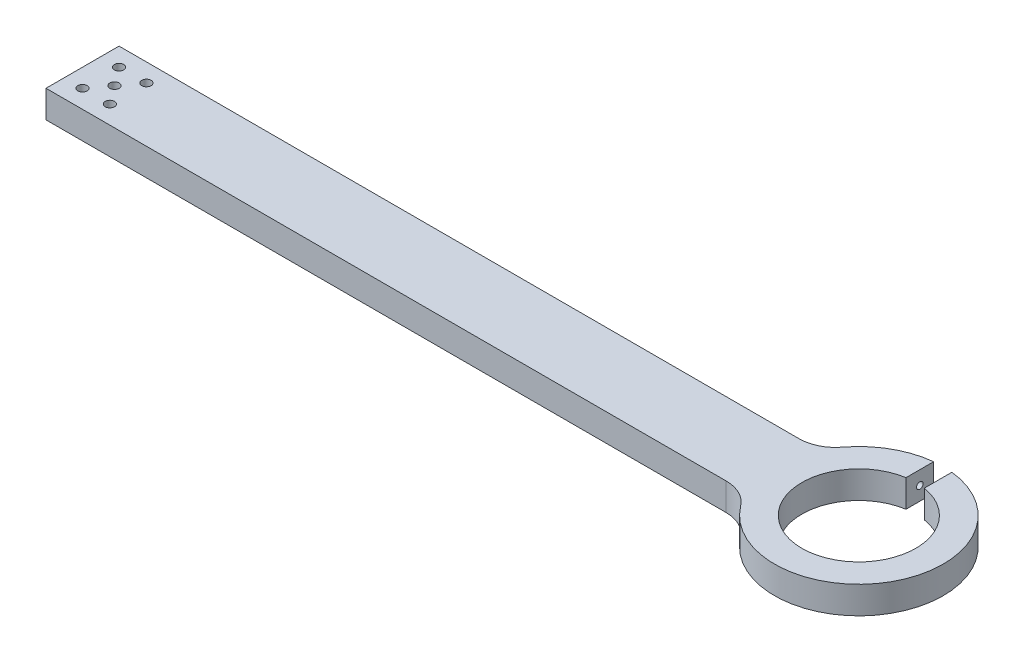
ISO-10303-21;
HEADER;
FILE_DESCRIPTION(('STEP AP214'),'2;1');
FILE_NAME('part.step','',(''),(''),'','','');
FILE_SCHEMA(('AUTOMOTIVE_DESIGN { 1 0 10303 214 1 1 1 1 }'));
ENDSEC;
DATA;
#1=APPLICATION_CONTEXT('core data for automotive mechanical design processes');
#2=APPLICATION_PROTOCOL_DEFINITION('international standard','automotive_design',2000,#1);
#3=PRODUCT_CONTEXT('',#1,'mechanical');
#4=PRODUCT('Part','Part','',(#3));
#5=PRODUCT_RELATED_PRODUCT_CATEGORY('part','',(#4));
#6=PRODUCT_DEFINITION_FORMATION('','',#4);
#7=PRODUCT_DEFINITION_CONTEXT('part definition',#1,'design');
#8=PRODUCT_DEFINITION('design','',#6,#7);
#9=PRODUCT_DEFINITION_SHAPE('','',#8);
#10=(LENGTH_UNIT() NAMED_UNIT(*) SI_UNIT(.MILLI.,.METRE.));
#11=(NAMED_UNIT(*) PLANE_ANGLE_UNIT() SI_UNIT($,.RADIAN.));
#12=(NAMED_UNIT(*) SI_UNIT($,.STERADIAN.) SOLID_ANGLE_UNIT());
#13=UNCERTAINTY_MEASURE_WITH_UNIT(LENGTH_MEASURE(1.E-05),#10,'distance_accuracy_value','');
#14=(GEOMETRIC_REPRESENTATION_CONTEXT(3) GLOBAL_UNCERTAINTY_ASSIGNED_CONTEXT((#13)) GLOBAL_UNIT_ASSIGNED_CONTEXT((#10,
#11,#12)) REPRESENTATION_CONTEXT('',''));
#15=CARTESIAN_POINT('',(0.,0.,0.));
#16=DIRECTION('',(0.,0.,1.));
#17=DIRECTION('',(1.,0.,0.));
#18=AXIS2_PLACEMENT_3D('',#15,#16,#17);
#19=CARTESIAN_POINT('',(0.,4.7625,-12.7));
#20=DIRECTION('',(1.,0.,0.));
#21=DIRECTION('',(0.,0.,-1.));
#22=AXIS2_PLACEMENT_3D('',#19,#20,#21);
#23=PLANE('',#22);
#24=DIRECTION('',(0.,0.,1.));
#25=VECTOR('',#24,1.);
#26=CARTESIAN_POINT('',(0.,-4.7625,-12.7));
#27=LINE('',#26,#25);
#28=CARTESIAN_POINT('',(0.,-4.7625,-12.7));
#29=VERTEX_POINT('',#28);
#30=CARTESIAN_POINT('',(0.,-4.7625,12.7));
#31=VERTEX_POINT('',#30);
#32=EDGE_CURVE('E228',#29,#31,#27,.T.);
#33=ORIENTED_EDGE('',*,*,#32,.T.);
#34=DIRECTION('',(0.,-1.,0.));
#35=VECTOR('',#34,1.);
#36=CARTESIAN_POINT('',(0.,4.7625,12.7));
#37=LINE('',#36,#35);
#38=CARTESIAN_POINT('',(0.,4.7625,12.7));
#39=VERTEX_POINT('',#38);
#40=EDGE_CURVE('E256',#39,#31,#37,.T.);
#41=ORIENTED_EDGE('',*,*,#40,.F.);
#42=DIRECTION('',(0.,0.,1.));
#43=VECTOR('',#42,1.);
#44=CARTESIAN_POINT('',(0.,4.7625,-12.7));
#45=LINE('',#44,#43);
#46=CARTESIAN_POINT('',(0.,4.7625,-12.7));
#47=VERTEX_POINT('',#46);
#48=EDGE_CURVE('E245',#47,#39,#45,.T.);
#49=ORIENTED_EDGE('',*,*,#48,.F.);
#50=DIRECTION('',(0.,-1.,0.));
#51=VECTOR('',#50,1.);
#52=CARTESIAN_POINT('',(0.,4.7625,-12.7));
#53=LINE('',#52,#51);
#54=EDGE_CURVE('E219',#47,#29,#53,.T.);
#55=ORIENTED_EDGE('',*,*,#54,.T.);
#56=EDGE_LOOP('',(#33,#41,#49,#55));
#57=FACE_BOUND('',#56,.T.);
#58=ADVANCED_FACE('F38',(#57),#23,.F.);
#59=CARTESIAN_POINT('',(0.,4.7625,12.7));
#60=DIRECTION('',(0.,0.,-1.));
#61=DIRECTION('',(-1.,0.,0.));
#62=AXIS2_PLACEMENT_3D('',#59,#60,#61);
#63=PLANE('',#62);
#64=DIRECTION('',(1.,0.,0.));
#65=VECTOR('',#64,1.);
#66=CARTESIAN_POINT('',(0.,-4.7625,12.7));
#67=LINE('',#66,#65);
#68=CARTESIAN_POINT('',(236.48855016431,-4.7625,12.7));
#69=VERTEX_POINT('',#68);
#70=EDGE_CURVE('E230',#31,#69,#67,.T.);
#71=ORIENTED_EDGE('',*,*,#70,.T.);
#72=DIRECTION('',(0.,1.,0.));
#73=VECTOR('',#72,1.);
#74=CARTESIAN_POINT('',(236.48855016431,4.7625,12.7));
#75=LINE('',#74,#73);
#76=CARTESIAN_POINT('',(236.48855016431,4.7625,12.7));
#77=VERTEX_POINT('',#76);
#78=EDGE_CURVE('E66',#69,#77,#75,.T.);
#79=ORIENTED_EDGE('',*,*,#78,.T.);
#80=DIRECTION('',(1.,0.,0.));
#81=VECTOR('',#80,1.);
#82=CARTESIAN_POINT('',(0.,4.7625,12.7));
#83=LINE('',#82,#81);
#84=EDGE_CURVE('E153',#39,#77,#83,.T.);
#85=ORIENTED_EDGE('',*,*,#84,.F.);
#86=ORIENTED_EDGE('',*,*,#40,.T.);
#87=EDGE_LOOP('',(#71,#79,#85,#86));
#88=FACE_BOUND('',#87,.T.);
#89=ADVANCED_FACE('F140',(#88),#63,.F.);
#90=CARTESIAN_POINT('',(270.,4.7625,0.));
#91=DIRECTION('',(0.,-1.,0.));
#92=DIRECTION('',(0.,0.,-1.));
#93=AXIS2_PLACEMENT_3D('',#90,#91,#92);
#94=CYLINDRICAL_SURFACE('',#93,29.3497);
#95=DIRECTION('',(0.,-1.,0.));
#96=VECTOR('',#95,1.);
#97=CARTESIAN_POINT('',(282.7,4.7625,-26.4596842401794));
#98=LINE('',#97,#96);
#99=CARTESIAN_POINT('',(282.7,1.21197066000445,-26.4596842401794));
#100=VERTEX_POINT('',#99);
#101=CARTESIAN_POINT('',(282.7,-1.21197066000445,-26.4596842401794));
#102=VERTEX_POINT('',#101);
#103=EDGE_CURVE('E126',#100,#102,#98,.T.);
#104=ORIENTED_EDGE('',*,*,#103,.T.);
#105=CARTESIAN_POINT('',(282.7,-1.21197066000444,-26.4596842401794));
#106=CARTESIAN_POINT('',(282.750051124197,-1.25329873764153,-26.4356625780796));
#107=CARTESIAN_POINT('',(282.801101674612,-1.29298690635019,-26.410983284436));
#108=CARTESIAN_POINT('',(282.904794393227,-1.36936711915129,-26.3604717622231));
#109=CARTESIAN_POINT('',(282.957435520752,-1.40606106651418,-26.3346402824479));
#110=CARTESIAN_POINT('',(283.063833295128,-1.47669976053063,-26.2820218081668));
#111=CARTESIAN_POINT('',(283.117586803677,-1.51065118896463,-26.2552373800173));
#112=CARTESIAN_POINT('',(283.226095306812,-1.57614137180364,-26.2007439111944));
#113=CARTESIAN_POINT('',(283.280850488706,-1.60767966913271,-26.1730346967758));
#114=CARTESIAN_POINT('',(283.446043511303,-1.69882315409589,-26.0887723031969));
#115=CARTESIAN_POINT('',(283.557670149274,-1.75512699525818,-26.0309553772976));
#116=CARTESIAN_POINT('',(283.783039062422,-1.86002520705119,-25.9123327380884));
#117=CARTESIAN_POINT('',(283.896783245729,-1.90861220690676,-25.8515242390968));
#118=CARTESIAN_POINT('',(284.200626335862,-2.0282936869004,-25.6864458794719));
#119=CARTESIAN_POINT('',(284.391885634554,-2.09325560647805,-25.5798235297073));
#120=CARTESIAN_POINT('',(284.775808655515,-2.20541868807797,-25.3599955728221));
#121=CARTESIAN_POINT('',(284.968472715948,-2.25261541930172,-25.2467883314875));
#122=CARTESIAN_POINT('',(285.354372896863,-2.32958557802799,-25.0139776286063));
#123=CARTESIAN_POINT('',(285.547608656684,-2.35929738328666,-24.894353147345));
#124=CARTESIAN_POINT('',(285.932571574913,-2.40029686390625,-24.649746531512));
#125=CARTESIAN_POINT('',(286.124299409049,-2.41159332209235,-24.5247669801382));
#126=CARTESIAN_POINT('',(286.442962432453,-2.41374256663724,-24.3116796786579));
#127=CARTESIAN_POINT('',(286.570694218422,-2.41004849374634,-24.2247967952362));
#128=CARTESIAN_POINT('',(286.824310246248,-2.39280267618088,-24.0493498794949));
#129=CARTESIAN_POINT('',(286.950194931957,-2.37925334062029,-23.9607862631815));
#130=CARTESIAN_POINT('',(287.199128997994,-2.34142105749057,-23.7827288540588));
#131=CARTESIAN_POINT('',(287.322185748331,-2.31717041739526,-23.6932386467833));
#132=CARTESIAN_POINT('',(287.5649649807,-2.25678991766118,-23.5138188167865));
#133=CARTESIAN_POINT('',(287.684688896582,-2.2206652548867,-23.4238894032237));
#134=CARTESIAN_POINT('',(287.953273879696,-2.12292745017628,-23.2189761435059));
#135=CARTESIAN_POINT('',(288.100727584217,-2.05698596681019,-23.1041475069809));
#136=CARTESIAN_POINT('',(288.384957972101,-1.89944125062337,-22.8786135039784));
#137=CARTESIAN_POINT('',(288.521743972152,-1.80786073806069,-22.7679045847363));
#138=CARTESIAN_POINT('',(288.742343697789,-1.62527955835916,-22.5863619431623));
#139=CARTESIAN_POINT('',(288.83015598297,-1.54152763434976,-22.513145055175));
#140=CARTESIAN_POINT('',(288.994222049655,-1.35749904563977,-22.3748932961783));
#141=CARTESIAN_POINT('',(289.070495217096,-1.25725070050145,-22.3098447341988));
#142=CARTESIAN_POINT('',(289.191004583641,-1.06574490090438,-22.2061930709192));
#143=CARTESIAN_POINT('',(289.238547796922,-0.978001965855499,-22.1649777682916));
#144=CARTESIAN_POINT('',(289.322131183464,-0.793420723564877,-22.0921526960081));
#145=CARTESIAN_POINT('',(289.358177547699,-0.696587347950246,-22.0605377570628));
#146=CARTESIAN_POINT('',(289.416649598477,-0.494780799216568,-22.0090928381109));
#147=CARTESIAN_POINT('',(289.438947211099,-0.389741063856326,-21.9893737068967));
#148=CARTESIAN_POINT('',(289.467445805109,-0.175843841064166,-21.9641488228857));
#149=CARTESIAN_POINT('',(289.473661963957,-0.0669900517226581,-21.9586296683691));
#150=CARTESIAN_POINT('',(289.469763100197,0.134552784015755,-21.9620854116629));
#151=CARTESIAN_POINT('',(289.461852783386,0.227331070312829,-21.9691036618426));
#152=CARTESIAN_POINT('',(289.434394909052,0.409745551033289,-21.9933971298041));
#153=CARTESIAN_POINT('',(289.414846467199,0.499381506136451,-22.0106731270273));
#154=CARTESIAN_POINT('',(289.365390772965,0.673140054368543,-22.0541967814052));
#155=CARTESIAN_POINT('',(289.335509145763,0.757275679669371,-22.0804222427621));
#156=CARTESIAN_POINT('',(289.266902238231,0.91898340384426,-22.1403126641297));
#157=CARTESIAN_POINT('',(289.228173446809,0.996552880075071,-22.1739805775862));
#158=CARTESIAN_POINT('',(289.121300375129,1.18302893266705,-22.2662965093944));
#159=CARTESIAN_POINT('',(289.048333243675,1.28725175616303,-22.3288295121896));
#160=CARTESIAN_POINT('',(288.889917874362,1.47911189090206,-22.4630074963159));
#161=CARTESIAN_POINT('',(288.804437732063,1.5667054505264,-22.5346757074559));
#162=CARTESIAN_POINT('',(288.647437639819,1.70593046267336,-22.664632431965));
#163=CARTESIAN_POINT('',(288.577907737849,1.7610389597119,-22.7216791488172));
#164=CARTESIAN_POINT('',(288.434833802162,1.86323917502304,-22.8379139581896));
#165=CARTESIAN_POINT('',(288.361287821249,1.91032695805076,-22.8971030846828));
#166=CARTESIAN_POINT('',(288.135784709005,2.04053964340112,-23.0767188299202));
#167=CARTESIAN_POINT('',(287.978985561554,2.11259428432524,-23.1991745515965));
#168=CARTESIAN_POINT('',(287.690821331106,2.21912366037501,-23.4193423265481));
#169=CARTESIAN_POINT('',(287.560966164589,2.25830076911906,-23.5168923099072));
#170=CARTESIAN_POINT('',(287.297352222307,2.3227702938882,-23.7114593398893));
#171=CARTESIAN_POINT('',(287.163591282834,2.34805485396269,-23.8084760543277));
#172=CARTESIAN_POINT('',(286.892829764393,2.38622036566326,-24.0013529175634));
#173=CARTESIAN_POINT('',(286.755819475929,2.39905754395495,-24.0972078224877));
#174=CARTESIAN_POINT('',(286.479810204677,2.41332721083388,-24.2868027604675));
#175=CARTESIAN_POINT('',(286.340811399758,2.41476071314656,-24.3805429807684));
#176=CARTESIAN_POINT('',(286.008756518469,2.40565909524498,-24.6003612318301));
#177=CARTESIAN_POINT('',(285.815072607554,2.39040909199523,-24.7253104389047));
#178=CARTESIAN_POINT('',(285.426457631297,2.34143063682995,-24.9696223888027));
#179=CARTESIAN_POINT('',(285.231526011326,2.30769330800274,-25.0889824180064));
#180=CARTESIAN_POINT('',(284.842686875056,2.22248222059297,-25.3209499477443));
#181=CARTESIAN_POINT('',(284.64877867064,2.17108828508829,-25.4335852052758));
#182=CARTESIAN_POINT('',(284.359382433434,2.08031118283989,-25.5973698517258));
#183=CARTESIAN_POINT('',(284.263165111932,2.04777266054992,-25.6511013539634));
#184=CARTESIAN_POINT('',(284.07147800756,1.97792227129344,-25.7567536844921));
#185=CARTESIAN_POINT('',(283.976008117014,1.94061110582742,-25.8086747774594));
#186=CARTESIAN_POINT('',(283.778048095649,1.85750937440061,-25.9149369382837));
#187=CARTESIAN_POINT('',(283.675654703319,1.81126678624605,-25.9691060102252));
#188=CARTESIAN_POINT('',(283.472828019839,1.71224433666097,-26.0749084988788));
#189=CARTESIAN_POINT('',(283.372393135544,1.65947006916782,-26.1265440331807));
#190=CARTESIAN_POINT('',(283.223723310413,1.57464347819945,-26.2019300483732));
#191=CARTESIAN_POINT('',(283.174429879561,1.54537904145109,-26.2267472762266));
#192=CARTESIAN_POINT('',(283.076718552324,1.48482030201255,-26.2756028270637));
#193=CARTESIAN_POINT('',(283.028300523769,1.45352630907711,-26.2996412680715));
#194=CARTESIAN_POINT('',(282.932427608899,1.38865451153463,-26.3469175479996));
#195=CARTESIAN_POINT('',(282.884975077183,1.35507183155355,-26.3701535082139));
#196=CARTESIAN_POINT('',(282.791406315453,1.28543258281486,-26.4156684420658));
#197=CARTESIAN_POINT('',(282.74529078773,1.24937474625063,-26.4379469156224));
#198=CARTESIAN_POINT('',(282.699999999999,1.21197066000634,-26.4596842401798));
#199=B_SPLINE_CURVE_WITH_KNOTS('',3,(#105,#106,#107,#108,#109,#110,#111,#112,#113,#114,#115,
#116,#117,#118,#119,#120,#121,#122,#123,#124,#125,#126,#127,#128,#129,#130,#131,#132,#133,#134,
#135,#136,#137,#138,#139,#140,#141,#142,#143,#144,#145,#146,#147,#148,#149,#150,#151,#152,#153,
#154,#155,#156,#157,#158,#159,#160,#161,#162,#163,#164,#165,#166,#167,#168,#169,#170,#171,#172,
#173,#174,#175,#176,#177,#178,#179,#180,#181,#182,#183,#184,#185,#186,#187,#188,#189,#190,#191,
#192,#193,#194,#195,#196,#197,#198),.UNSPECIFIED.,.F.,.F.,(4,2,2,2,2,2,2,2,2,2,2,2,2,2,2,2,2,2,
2,2,2,2,2,2,2,2,2,2,2,2,2,2,2,2,2,2,2,2,2,2,2,2,2,2,2,2,4),(0.,0.207562156677144,
0.414991332138695,0.621898852492137,0.828845467086886,1.24172900993071,1.65500457894354,
2.33927596653268,3.0237179046852,3.71055779991054,4.39707002488198,4.86035384150416,
5.32352444667576,5.78530619555345,6.24688610645155,6.83986122126179,7.43231252007061,
7.85619809293541,8.27936342698228,8.60207934672442,8.92462119159159,9.25012393414576,
9.57531935933573,9.85409090780531,10.1328836416188,10.4109898998814,10.6892067199591,
11.1121202986101,11.536131594201,11.852141000048,12.1683050074194,12.8007395675926,
13.3013668329185,13.802276902076,14.3049421858432,14.8075627848725,15.4996316809521,
16.1920331737853,16.8813447321341,17.2259734717627,17.5705516146831,17.9445563533469,
18.318242970632,18.5056087181306,18.6929459365014,18.8806955107322,19.0685419808),.UNSPECIFIED.);
#200=EDGE_CURVE('E11',#102,#100,#199,.T.);
#201=ORIENTED_EDGE('',*,*,#200,.T.);
#202=EDGE_LOOP('',(#104,#201));
#203=FACE_BOUND('',#202,.T.);
#204=CARTESIAN_POINT('',(270.,4.7625,0.));
#205=DIRECTION('',(0.,1.,0.));
#206=DIRECTION('',(0.,0.,-1.));
#207=AXIS2_PLACEMENT_3D('',#204,#205,#206);
#208=CIRCLE('',#207,29.3497);
#209=CARTESIAN_POINT('',(246.609797471978,4.7625,17.7286016309272));
#210=VERTEX_POINT('',#209);
#211=CARTESIAN_POINT('',(273.175,4.7625,-29.177461594354));
#212=VERTEX_POINT('',#211);
#213=EDGE_CURVE('E144',#210,#212,#208,.T.);
#214=ORIENTED_EDGE('',*,*,#213,.F.);
#215=DIRECTION('',(0.,-1.,0.));
#216=VECTOR('',#215,1.);
#217=CARTESIAN_POINT('',(246.609797471978,4.7625,17.7286016309272));
#218=LINE('',#217,#216);
#219=CARTESIAN_POINT('',(246.609797471978,-4.7625,17.7286016309272));
#220=VERTEX_POINT('',#219);
#221=EDGE_CURVE('E146',#210,#220,#218,.T.);
#222=ORIENTED_EDGE('',*,*,#221,.T.);
#223=CARTESIAN_POINT('',(270.,-4.7625,0.));
#224=DIRECTION('',(0.,1.,0.));
#225=DIRECTION('',(0.,0.,-1.));
#226=AXIS2_PLACEMENT_3D('',#223,#224,#225);
#227=CIRCLE('',#226,29.3497);
#228=CARTESIAN_POINT('',(273.175,-4.7625,-29.177461594354));
#229=VERTEX_POINT('',#228);
#230=EDGE_CURVE('E233',#220,#229,#227,.T.);
#231=ORIENTED_EDGE('',*,*,#230,.T.);
#232=DIRECTION('',(0.,-1.,0.));
#233=VECTOR('',#232,1.);
#234=CARTESIAN_POINT('',(273.175,4.7625,-29.177461594354));
#235=LINE('',#234,#233);
#236=EDGE_CURVE('E149',#212,#229,#235,.T.);
#237=ORIENTED_EDGE('',*,*,#236,.F.);
#238=EDGE_LOOP('',(#214,#222,#231,#237));
#239=FACE_BOUND('',#238,.T.);
#240=ADVANCED_FACE('F136',(#203,#239),#94,.T.);
#241=CARTESIAN_POINT('',(273.175,4.7625,-29.177461594354));
#242=DIRECTION('',(1.,0.,0.));
#243=DIRECTION('',(0.,0.,-1.));
#244=AXIS2_PLACEMENT_3D('',#241,#242,#243);
#245=PLANE('',#244);
#246=CARTESIAN_POINT('',(273.175,0.,-24.3731329900808));
#247=DIRECTION('',(-1.,0.,0.));
#248=DIRECTION('',(0.,0.,1.));
#249=AXIS2_PLACEMENT_3D('',#246,#247,#248);
#250=CIRCLE('',#249,1.1303);
#251=CARTESIAN_POINT('',(273.175,0.,-23.2428329900808));
#252=VERTEX_POINT('',#251);
#253=EDGE_CURVE('E129',#252,#252,#250,.T.);
#254=ORIENTED_EDGE('',*,*,#253,.F.);
#255=EDGE_LOOP('',(#254));
#256=FACE_BOUND('',#255,.T.);
#257=DIRECTION('',(0.,0.,1.));
#258=VECTOR('',#257,1.);
#259=CARTESIAN_POINT('',(273.175,-4.7625,-29.177461594354));
#260=LINE('',#259,#258);
#261=CARTESIAN_POINT('',(273.175,-4.7625,-19.5688043858076));
#262=VERTEX_POINT('',#261);
#263=EDGE_CURVE('E235',#229,#262,#260,.T.);
#264=ORIENTED_EDGE('',*,*,#263,.T.);
#265=DIRECTION('',(0.,-1.,0.));
#266=VECTOR('',#265,1.);
#267=CARTESIAN_POINT('',(273.175,4.7625,-19.5688043858076));
#268=LINE('',#267,#266);
#269=CARTESIAN_POINT('',(273.175,4.7625,-19.5688043858076));
#270=VERTEX_POINT('',#269);
#271=EDGE_CURVE('E252',#270,#262,#268,.T.);
#272=ORIENTED_EDGE('',*,*,#271,.F.);
#273=DIRECTION('',(0.,0.,1.));
#274=VECTOR('',#273,1.);
#275=CARTESIAN_POINT('',(273.175,4.7625,-29.177461594354));
#276=LINE('',#275,#274);
#277=EDGE_CURVE('E152',#212,#270,#276,.T.);
#278=ORIENTED_EDGE('',*,*,#277,.F.);
#279=ORIENTED_EDGE('',*,*,#236,.T.);
#280=EDGE_LOOP('',(#264,#272,#278,#279));
#281=FACE_BOUND('',#280,.T.);
#282=ADVANCED_FACE('F139',(#256,#281),#245,.F.);
#283=CARTESIAN_POINT('',(270.,4.7625,0.));
#284=DIRECTION('',(0.,-1.,0.));
#285=DIRECTION('',(0.,0.,-1.));
#286=AXIS2_PLACEMENT_3D('',#283,#284,#285);
#287=CYLINDRICAL_SURFACE('',#286,19.8247);
#288=CARTESIAN_POINT('',(270.,-4.7625,0.));
#289=DIRECTION('',(0.,-1.,0.));
#290=DIRECTION('',(0.,0.,1.));
#291=AXIS2_PLACEMENT_3D('',#288,#289,#290);
#292=CIRCLE('',#291,19.8247);
#293=CARTESIAN_POINT('',(266.825,-4.7625,-19.5688043858076));
#294=VERTEX_POINT('',#293);
#295=EDGE_CURVE('E237',#262,#294,#292,.T.);
#296=ORIENTED_EDGE('',*,*,#295,.T.);
#297=DIRECTION('',(0.,-1.,0.));
#298=VECTOR('',#297,1.);
#299=CARTESIAN_POINT('',(266.825,4.7625,-19.5688043858076));
#300=LINE('',#299,#298);
#301=CARTESIAN_POINT('',(266.825,4.7625,-19.5688043858076));
#302=VERTEX_POINT('',#301);
#303=EDGE_CURVE('E249',#302,#294,#300,.T.);
#304=ORIENTED_EDGE('',*,*,#303,.F.);
#305=CARTESIAN_POINT('',(270.,4.7625,0.));
#306=DIRECTION('',(0.,-1.,0.));
#307=DIRECTION('',(0.,0.,1.));
#308=AXIS2_PLACEMENT_3D('',#305,#306,#307);
#309=CIRCLE('',#308,19.8247);
#310=EDGE_CURVE('E306',#270,#302,#309,.T.);
#311=ORIENTED_EDGE('',*,*,#310,.F.);
#312=ORIENTED_EDGE('',*,*,#271,.T.);
#313=EDGE_LOOP('',(#296,#304,#311,#312));
#314=FACE_BOUND('',#313,.T.);
#315=ADVANCED_FACE('F289',(#314),#287,.F.);
#316=CARTESIAN_POINT('',(266.825,4.7625,-19.5688043858076));
#317=DIRECTION('',(-1.,0.,0.));
#318=DIRECTION('',(0.,0.,1.));
#319=AXIS2_PLACEMENT_3D('',#316,#317,#318);
#320=PLANE('',#319);
#321=CARTESIAN_POINT('',(266.825,0.,-24.3731329900808));
#322=DIRECTION('',(1.,0.,0.));
#323=DIRECTION('',(0.,0.,-1.));
#324=AXIS2_PLACEMENT_3D('',#321,#322,#323);
#325=CIRCLE('',#324,1.13029999999997);
#326=CARTESIAN_POINT('',(266.825,0.,-25.5034329900807));
#327=VERTEX_POINT('',#326);
#328=EDGE_CURVE('E265',#327,#327,#325,.T.);
#329=ORIENTED_EDGE('',*,*,#328,.F.);
#330=EDGE_LOOP('',(#329));
#331=FACE_BOUND('',#330,.T.);
#332=DIRECTION('',(0.,0.,-1.));
#333=VECTOR('',#332,1.);
#334=CARTESIAN_POINT('',(266.825,-4.7625,-19.5688043858076));
#335=LINE('',#334,#333);
#336=CARTESIAN_POINT('',(266.825,-4.7625,-29.177461594354));
#337=VERTEX_POINT('',#336);
#338=EDGE_CURVE('E239',#294,#337,#335,.T.);
#339=ORIENTED_EDGE('',*,*,#338,.T.);
#340=DIRECTION('',(0.,-1.,0.));
#341=VECTOR('',#340,1.);
#342=CARTESIAN_POINT('',(266.825,4.7625,-29.177461594354));
#343=LINE('',#342,#341);
#344=CARTESIAN_POINT('',(266.825,4.7625,-29.177461594354));
#345=VERTEX_POINT('',#344);
#346=EDGE_CURVE('E222',#345,#337,#343,.T.);
#347=ORIENTED_EDGE('',*,*,#346,.F.);
#348=DIRECTION('',(0.,0.,-1.));
#349=VECTOR('',#348,1.);
#350=CARTESIAN_POINT('',(266.825,4.7625,-19.5688043858076));
#351=LINE('',#350,#349);
#352=EDGE_CURVE('E224',#302,#345,#351,.T.);
#353=ORIENTED_EDGE('',*,*,#352,.F.);
#354=ORIENTED_EDGE('',*,*,#303,.T.);
#355=EDGE_LOOP('',(#339,#347,#353,#354));
#356=FACE_BOUND('',#355,.T.);
#357=ADVANCED_FACE('F284',(#331,#356),#320,.F.);
#358=CARTESIAN_POINT('',(270.,4.7625,0.));
#359=DIRECTION('',(0.,-1.,0.));
#360=DIRECTION('',(0.,0.,-1.));
#361=AXIS2_PLACEMENT_3D('',#358,#359,#360);
#362=CYLINDRICAL_SURFACE('',#361,29.3497);
#363=CARTESIAN_POINT('',(255.4748564272,0.,-25.5034329900807));
#364=CARTESIAN_POINT('',(255.474852557362,0.0338034003049227,-25.5034308534571));
#365=CARTESIAN_POINT('',(255.472162361053,0.0676516263213047,-25.5018991960165));
#366=CARTESIAN_POINT('',(255.461684603031,0.134307770758166,-25.4959273082542));
#367=CARTESIAN_POINT('',(255.453885688913,0.167113201283325,-25.4914806001978));
#368=CARTESIAN_POINT('',(255.43155720458,0.238412527803232,-25.4787276697649));
#369=CARTESIAN_POINT('',(255.415873770397,0.276422420750014,-25.4697583828014));
#370=CARTESIAN_POINT('',(255.379444398984,0.349020973931966,-25.4488641391816));
#371=CARTESIAN_POINT('',(255.358689691611,0.383603559847489,-25.4369340616341));
#372=CARTESIAN_POINT('',(255.300629302506,0.468107592844855,-25.4034456189282));
#373=CARTESIAN_POINT('',(255.260637177381,0.515521390312054,-25.3802776746506));
#374=CARTESIAN_POINT('',(255.175210371615,0.603006165636676,-25.3304751329926));
#375=CARTESIAN_POINT('',(255.129761923829,0.643057895649436,-25.3038317512596));
#376=CARTESIAN_POINT('',(255.039329517761,0.713912439508471,-25.2504605903019));
#377=CARTESIAN_POINT('',(254.994612748178,0.745204234368355,-25.2239186787796));
#378=CARTESIAN_POINT('',(254.903197701184,0.803284748708342,-25.1693124602008));
#379=CARTESIAN_POINT('',(254.856497847442,0.830069798619954,-25.1412469369154));
#380=CARTESIAN_POINT('',(254.761658152014,0.879693429727285,-25.0838774083796));
#381=CARTESIAN_POINT('',(254.713515828855,0.902524690612718,-25.0545712282887));
#382=CARTESIAN_POINT('',(254.616263692293,0.944573420449099,-24.994975584261));
#383=CARTESIAN_POINT('',(254.567153581154,0.963789757486269,-24.9646858158103));
#384=CARTESIAN_POINT('',(254.437194469858,1.00991322524006,-24.8839896614668));
#385=CARTESIAN_POINT('',(254.355786053725,1.03406916183391,-24.8328984527931));
#386=CARTESIAN_POINT('',(254.192038842279,1.07426698700852,-24.7289844977882));
#387=CARTESIAN_POINT('',(254.109699479066,1.09030361548036,-24.676160652497));
#388=CARTESIAN_POINT('',(253.94471353686,1.11452809556647,-24.5691338699686));
#389=CARTESIAN_POINT('',(253.862066839139,1.12271250756832,-24.5149303390313));
#390=CARTESIAN_POINT('',(253.697075787409,1.13116695368705,-24.4055186903934));
#391=CARTESIAN_POINT('',(253.614731311857,1.13144062506775,-24.3503110460563));
#392=CARTESIAN_POINT('',(253.470026259145,1.12462353528824,-24.2522290904614));
#393=CARTESIAN_POINT('',(253.407492429994,1.11923877194925,-24.209487453323));
#394=CARTESIAN_POINT('',(253.283206222322,1.10332495742019,-24.1238344280743));
#395=CARTESIAN_POINT('',(253.221453676361,1.09279702833389,-24.0809230790152));
#396=CARTESIAN_POINT('',(253.099221889358,1.06621827703574,-23.995294181338));
#397=CARTESIAN_POINT('',(253.038739957766,1.05018071518669,-23.9525764146519));
#398=CARTESIAN_POINT('',(252.919406017676,1.01203124480706,-23.8676257486051));
#399=CARTESIAN_POINT('',(252.860553053678,0.989922983995817,-23.825392573892));
#400=CARTESIAN_POINT('',(252.7378724992,0.935707031751531,-23.7366859489075));
#401=CARTESIAN_POINT('',(252.674342815225,0.902694780861699,-23.6903424595669));
#402=CARTESIAN_POINT('',(252.55157669975,0.826697020995685,-23.6000676341119));
#403=CARTESIAN_POINT('',(252.492337204488,0.783718723122521,-23.5561345821721));
#404=CARTESIAN_POINT('',(252.39441387659,0.698255498147121,-23.482993792439));
#405=CARTESIAN_POINT('',(252.354270904529,0.658280197541106,-23.4528323912634));
#406=CARTESIAN_POINT('',(252.27945176961,0.57110591240461,-23.3963510436987));
#407=CARTESIAN_POINT('',(252.244765469857,0.523920651319826,-23.3700239811524));
#408=CARTESIAN_POINT('',(252.191764151751,0.436289946922703,-23.3296467179237));
#409=CARTESIAN_POINT('',(252.171579152833,0.39762110381402,-23.3142186474939));
#410=CARTESIAN_POINT('',(252.136393936499,0.316692550164793,-23.2872703348297));
#411=CARTESIAN_POINT('',(252.121389936447,0.274435487579481,-23.2757472416946));
#412=CARTESIAN_POINT('',(252.097598463644,0.186709425486988,-23.2574534797052));
#413=CARTESIAN_POINT('',(252.088873072482,0.141213110469652,-23.2507302761451));
#414=CARTESIAN_POINT('',(252.078774435959,0.048941748411544,-23.2429475252839));
#415=CARTESIAN_POINT('',(252.07739436039,0.00216792998977353,-23.2418827163965));
#416=CARTESIAN_POINT('',(252.081774572962,-0.0841073691995423,-23.2452594924735));
#417=CARTESIAN_POINT('',(252.086545356926,-0.123695333428976,-23.2489380181471));
#418=CARTESIAN_POINT('',(252.101191593832,-0.201329126621615,-23.2602156578162));
#419=CARTESIAN_POINT('',(252.111069079333,-0.239374335033116,-23.2678163328952));
#420=CARTESIAN_POINT('',(252.138379289774,-0.322586204930334,-23.2887904164847));
#421=CARTESIAN_POINT('',(252.157099339349,-0.367080079999,-23.3031439141634));
#422=CARTESIAN_POINT('',(252.200074027832,-0.451633169267857,-23.3359863306524));
#423=CARTESIAN_POINT('',(252.224338122699,-0.491684631058186,-23.3544823138338));
#424=CARTESIAN_POINT('',(252.28866058965,-0.583814075319829,-23.4033245222533));
#425=CARTESIAN_POINT('',(252.330972528099,-0.633436507935609,-23.4353053163617));
#426=CARTESIAN_POINT('',(252.421393067201,-0.723889870077616,-23.5032058372586));
#427=CARTESIAN_POINT('',(252.46951394768,-0.764701648302725,-23.5391338934439));
#428=CARTESIAN_POINT('',(252.559914706211,-0.831327800552842,-23.6061611353018));
#429=CARTESIAN_POINT('',(252.601512957308,-0.858515433970738,-23.6368423029937));
#430=CARTESIAN_POINT('',(252.686624683869,-0.908328806440071,-23.6992556768041));
#431=CARTESIAN_POINT('',(252.730139290185,-0.930951806710395,-23.7309885007027));
#432=CARTESIAN_POINT('',(252.862922379222,-0.992678068742563,-23.8272399365438));
#433=CARTESIAN_POINT('',(252.954368522887,-1.02559567199495,-23.8927657200602));
#434=CARTESIAN_POINT('',(253.120550321381,-1.07193945464833,-24.0103551726033));
#435=CARTESIAN_POINT('',(253.194679674294,-1.08802797091379,-24.0623025047632));
#436=CARTESIAN_POINT('',(253.344323434979,-1.11246196847891,-24.1661252886517));
#437=CARTESIAN_POINT('',(253.419838621756,-1.12080294976455,-24.2180006811525));
#438=CARTESIAN_POINT('',(253.571831694308,-1.13030864459476,-24.3213620250559));
#439=CARTESIAN_POINT('',(253.648311483357,-1.13145575128176,-24.3728467131805));
#440=CARTESIAN_POINT('',(253.801585866515,-1.12686162129804,-24.4749820801971));
#441=CARTESIAN_POINT('',(253.878380371103,-1.12112222406213,-24.5256329781378));
#442=CARTESIAN_POINT('',(254.03465668933,-1.10253319883657,-24.6276617293224));
#443=CARTESIAN_POINT('',(254.114135119848,-1.08943363378778,-24.6789994935853));
#444=CARTESIAN_POINT('',(254.272511072881,-1.05579242057187,-24.7802303974854));
#445=CARTESIAN_POINT('',(254.351408241722,-1.03524657082423,-24.8301227043219));
#446=CARTESIAN_POINT('',(254.507727319463,-0.986275862175328,-24.9279532475944));
#447=CARTESIAN_POINT('',(254.585152169877,-0.957868988946374,-24.9758956614777));
#448=CARTESIAN_POINT('',(254.737599847584,-0.892260635075167,-25.0693440382399));
#449=CARTESIAN_POINT('',(254.812625810338,-0.85507121588395,-25.1148532385561));
#450=CARTESIAN_POINT('',(254.953424857998,-0.773310611709856,-25.1994380872357));
#451=CARTESIAN_POINT('',(255.019473786416,-0.729474988702303,-25.2387408902607));
#452=CARTESIAN_POINT('',(255.113829746517,-0.655538190211394,-25.2944295847801));
#453=CARTESIAN_POINT('',(255.144443208269,-0.629584207588677,-25.3124179611265));
#454=CARTESIAN_POINT('',(255.20357997484,-0.574592229449013,-25.3470316136996));
#455=CARTESIAN_POINT('',(255.232105222797,-0.545557164223322,-25.363658158904));
#456=CARTESIAN_POINT('',(255.285124818277,-0.485361866671883,-25.3944528943465));
#457=CARTESIAN_POINT('',(255.309740502184,-0.45434892803956,-25.408696541275));
#458=CARTESIAN_POINT('',(255.355383977221,-0.388839673008948,-25.435031081226));
#459=CARTESIAN_POINT('',(255.376408412974,-0.354340146396395,-25.4471199614609));
#460=CARTESIAN_POINT('',(255.4137323616,-0.2813281150764,-25.4685326860197));
#461=CARTESIAN_POINT('',(255.429958990533,-0.24276470272536,-25.4778139235701));
#462=CARTESIAN_POINT('',(255.455464845634,-0.162749689284721,-25.4923833987603));
#463=CARTESIAN_POINT('',(255.464775938456,-0.121312310121852,-25.4976899526353));
#464=CARTESIAN_POINT('',(255.471592405983,-0.0661474361216958,-25.5015737672359));
#465=CARTESIAN_POINT('',(255.472813053869,-0.0529612389770086,-25.5022691206471));
#466=CARTESIAN_POINT('',(255.47444592299,-0.0265190056623893,-25.503199207827));
#467=CARTESIAN_POINT('',(255.474857945552,-0.0132629531314364,-25.5034338283969));
#468=CARTESIAN_POINT('',(255.4748564272,0.,-25.5034329900807));
#469=B_SPLINE_CURVE_WITH_KNOTS('',3,(#363,#364,#365,#366,#367,#368,#369,#370,#371,#372,#373,
#374,#375,#376,#377,#378,#379,#380,#381,#382,#383,#384,#385,#386,#387,#388,#389,#390,#391,#392,
#393,#394,#395,#396,#397,#398,#399,#400,#401,#402,#403,#404,#405,#406,#407,#408,#409,#410,#411,
#412,#413,#414,#415,#416,#417,#418,#419,#420,#421,#422,#423,#424,#425,#426,#427,#428,#429,#430,
#431,#432,#433,#434,#435,#436,#437,#438,#439,#440,#441,#442,#443,#444,#445,#446,#447,#448,#449,
#450,#451,#452,#453,#454,#455,#456,#457,#458,#459,#460,#461,#462,#463,#464,#465,#466,#467,#468),
.UNSPECIFIED.,.T.,.F.,(4,2,2,2,2,2,2,2,2,2,2,2,2,2,2,2,2,2,2,2,2,2,2,2,2,2,2,2,2,2,2,2,2,2,2,2,
2,2,2,2,2,2,2,2,2,2,2,2,2,2,2,2,4),(0.,0.101354044022323,0.202934080807939,0.328480260633813,
0.454245113246619,0.651773760862183,0.849811713861865,1.03161958291722,1.21357477810532,
1.39586333693842,1.57820887974654,1.87509399399695,2.17217120049606,2.46937848040059,
2.76644910578148,2.99409938817438,3.2217000254167,3.44875667624095,3.67567719227219,
3.93096643662476,4.18607153532852,4.37804982952297,4.56966716205644,4.70797947012685,
4.84619058210358,4.98575018943525,5.12518000137188,5.24474051728506,5.36434865710558,
5.51460112315038,5.66511179949811,5.88180343467026,6.09896144269492,6.27392817177262,
6.44899957078382,6.79940327713046,7.07490693366733,7.35057051158321,7.62690850788149,
7.90317270873933,8.18944047325135,8.4758700170255,8.76164956510718,9.04703889901451,
9.31162799958629,9.44343591315654,9.57511957445987,9.70107762067896,9.82715271581424,
9.95505476941742,10.0823637327668,10.1221207918849,10.1618876178084),.UNSPECIFIED.);
#470=CARTESIAN_POINT('',(255.4748564272,0.,-25.5034329900807));
#471=VERTEX_POINT('',#470);
#472=EDGE_CURVE('E231',#471,#471,#469,.T.);
#473=ORIENTED_EDGE('',*,*,#472,.T.);
#474=EDGE_LOOP('',(#473));
#475=FACE_BOUND('',#474,.T.);
#476=CARTESIAN_POINT('',(270.,-4.7625,0.));
#477=DIRECTION('',(0.,1.,0.));
#478=DIRECTION('',(0.,0.,-1.));
#479=AXIS2_PLACEMENT_3D('',#476,#477,#478);
#480=CIRCLE('',#479,29.3497);
#481=CARTESIAN_POINT('',(246.609797471978,-4.7625,-17.7286016309272));
#482=VERTEX_POINT('',#481);
#483=EDGE_CURVE('E241',#337,#482,#480,.T.);
#484=ORIENTED_EDGE('',*,*,#483,.T.);
#485=DIRECTION('',(0.,-1.,0.));
#486=VECTOR('',#485,1.);
#487=CARTESIAN_POINT('',(246.609797471978,4.7625,-17.7286016309272));
#488=LINE('',#487,#486);
#489=CARTESIAN_POINT('',(246.609797471978,4.7625,-17.7286016309272));
#490=VERTEX_POINT('',#489);
#491=EDGE_CURVE('E158',#482,#490,#488,.F.);
#492=ORIENTED_EDGE('',*,*,#491,.T.);
#493=CARTESIAN_POINT('',(270.,4.7625,0.));
#494=DIRECTION('',(0.,1.,0.));
#495=DIRECTION('',(0.,0.,-1.));
#496=AXIS2_PLACEMENT_3D('',#493,#494,#495);
#497=CIRCLE('',#496,29.3497);
#498=EDGE_CURVE('E214',#345,#490,#497,.T.);
#499=ORIENTED_EDGE('',*,*,#498,.F.);
#500=ORIENTED_EDGE('',*,*,#346,.T.);
#501=EDGE_LOOP('',(#484,#492,#499,#500));
#502=FACE_BOUND('',#501,.T.);
#503=ADVANCED_FACE('F266',(#475,#502),#362,.T.);
#504=CARTESIAN_POINT('',(0.,4.7625,-12.7));
#505=DIRECTION('',(0.,0.,1.));
#506=DIRECTION('',(1.,0.,0.));
#507=AXIS2_PLACEMENT_3D('',#504,#505,#506);
#508=PLANE('',#507);
#509=DIRECTION('',(-1.,0.,0.));
#510=VECTOR('',#509,1.);
#511=CARTESIAN_POINT('',(0.,4.7625,-12.7));
#512=LINE('',#511,#510);
#513=CARTESIAN_POINT('',(236.48855016431,4.7625,-12.7));
#514=VERTEX_POINT('',#513);
#515=EDGE_CURVE('E211',#514,#47,#512,.T.);
#516=ORIENTED_EDGE('',*,*,#515,.F.);
#517=DIRECTION('',(0.,1.,0.));
#518=VECTOR('',#517,1.);
#519=CARTESIAN_POINT('',(236.48855016431,-4.7625,-12.7));
#520=LINE('',#519,#518);
#521=CARTESIAN_POINT('',(236.48855016431,-4.7625,-12.7));
#522=VERTEX_POINT('',#521);
#523=EDGE_CURVE('E162',#514,#522,#520,.F.);
#524=ORIENTED_EDGE('',*,*,#523,.T.);
#525=DIRECTION('',(-1.,0.,0.));
#526=VECTOR('',#525,1.);
#527=CARTESIAN_POINT('',(0.,-4.7625,-12.7));
#528=LINE('',#527,#526);
#529=EDGE_CURVE('E244',#522,#29,#528,.T.);
#530=ORIENTED_EDGE('',*,*,#529,.T.);
#531=ORIENTED_EDGE('',*,*,#54,.F.);
#532=EDGE_LOOP('',(#516,#524,#530,#531));
#533=FACE_BOUND('',#532,.T.);
#534=ADVANCED_FACE('F216',(#533),#508,.F.);
#535=CARTESIAN_POINT('',(270.,4.7625,0.));
#536=DIRECTION('',(0.,-1.,0.));
#537=DIRECTION('',(0.,0.,-1.));
#538=AXIS2_PLACEMENT_3D('',#535,#536,#537);
#539=PLANE('',#538);
#540=CARTESIAN_POINT('',(6.349999999997,4.7625,6.35000000000136));
#541=DIRECTION('',(0.,-1.,0.));
#542=DIRECTION('',(0.,0.,-1.));
#543=AXIS2_PLACEMENT_3D('',#540,#541,#542);
#544=CIRCLE('',#543,1.63195);
#545=CARTESIAN_POINT('',(6.349999999997,4.7625,4.71805000000136));
#546=VERTEX_POINT('',#545);
#547=EDGE_CURVE('E350',#546,#546,#544,.T.);
#548=ORIENTED_EDGE('',*,*,#547,.T.);
#549=EDGE_LOOP('',(#548));
#550=FACE_BOUND('',#549,.T.);
#551=CARTESIAN_POINT('',(15.874999999997,4.7625,-6.34999999999864));
#552=DIRECTION('',(0.,-1.,0.));
#553=DIRECTION('',(0.,0.,-1.));
#554=AXIS2_PLACEMENT_3D('',#551,#552,#553);
#555=CIRCLE('',#554,1.63195);
#556=CARTESIAN_POINT('',(15.874999999997,4.7625,-7.98194999999864));
#557=VERTEX_POINT('',#556);
#558=EDGE_CURVE('E344',#557,#557,#555,.T.);
#559=ORIENTED_EDGE('',*,*,#558,.T.);
#560=EDGE_LOOP('',(#559));
#561=FACE_BOUND('',#560,.T.);
#562=CARTESIAN_POINT('',(15.874999999997,4.7625,6.35000000000136));
#563=DIRECTION('',(0.,-1.,0.));
#564=DIRECTION('',(0.,0.,-1.));
#565=AXIS2_PLACEMENT_3D('',#562,#563,#564);
#566=CIRCLE('',#565,1.63195);
#567=CARTESIAN_POINT('',(15.874999999997,4.7625,4.71805000000136));
#568=VERTEX_POINT('',#567);
#569=EDGE_CURVE('E338',#568,#568,#566,.T.);
#570=ORIENTED_EDGE('',*,*,#569,.T.);
#571=EDGE_LOOP('',(#570));
#572=FACE_BOUND('',#571,.T.);
#573=CARTESIAN_POINT('',(11.112499999997,4.7625,1.37043154602168E-12));
#574=DIRECTION('',(0.,-1.,0.));
#575=DIRECTION('',(0.,0.,-1.));
#576=AXIS2_PLACEMENT_3D('',#573,#574,#575);
#577=CIRCLE('',#576,1.63195);
#578=CARTESIAN_POINT('',(11.112499999997,4.7625,-1.63194999999863));
#579=VERTEX_POINT('',#578);
#580=EDGE_CURVE('E332',#579,#579,#577,.T.);
#581=ORIENTED_EDGE('',*,*,#580,.T.);
#582=EDGE_LOOP('',(#581));
#583=FACE_BOUND('',#582,.T.);
#584=CARTESIAN_POINT('',(6.349999999997,4.7625,-6.34999999999864));
#585=DIRECTION('',(0.,-1.,0.));
#586=DIRECTION('',(0.,0.,-1.));
#587=AXIS2_PLACEMENT_3D('',#584,#585,#586);
#588=CIRCLE('',#587,1.63195);
#589=CARTESIAN_POINT('',(6.349999999997,4.7625,-7.98194999999864));
#590=VERTEX_POINT('',#589);
#591=EDGE_CURVE('E134',#590,#590,#588,.T.);
#592=ORIENTED_EDGE('',*,*,#591,.T.);
#593=EDGE_LOOP('',(#592));
#594=FACE_BOUND('',#593,.T.);
#595=ORIENTED_EDGE('',*,*,#48,.T.);
#596=ORIENTED_EDGE('',*,*,#84,.T.);
#597=CARTESIAN_POINT('',(236.48855016431,4.7625,25.4));
#598=DIRECTION('',(0.,-1.,0.));
#599=DIRECTION('',(0.,0.,-1.));
#600=AXIS2_PLACEMENT_3D('',#597,#598,#599);
#601=CIRCLE('',#600,12.7);
#602=EDGE_CURVE('E52',#77,#210,#601,.T.);
#603=ORIENTED_EDGE('',*,*,#602,.T.);
#604=ORIENTED_EDGE('',*,*,#213,.T.);
#605=ORIENTED_EDGE('',*,*,#277,.T.);
#606=ORIENTED_EDGE('',*,*,#310,.T.);
#607=ORIENTED_EDGE('',*,*,#352,.T.);
#608=ORIENTED_EDGE('',*,*,#498,.T.);
#609=CARTESIAN_POINT('',(236.48855016431,4.7625,-25.4));
#610=DIRECTION('',(0.,-1.,0.));
#611=DIRECTION('',(0.,0.,-1.));
#612=AXIS2_PLACEMENT_3D('',#609,#610,#611);
#613=CIRCLE('',#612,12.7);
#614=EDGE_CURVE('E167',#490,#514,#613,.T.);
#615=ORIENTED_EDGE('',*,*,#614,.T.);
#616=ORIENTED_EDGE('',*,*,#515,.T.);
#617=EDGE_LOOP('',(#595,#596,#603,#604,#605,#606,#607,#608,#615,#616));
#618=FACE_BOUND('',#617,.T.);
#619=ADVANCED_FACE('F210',(#550,#561,#572,#583,#594,#618),#539,.F.);
#620=CARTESIAN_POINT('',(270.,-4.7625,0.));
#621=DIRECTION('',(0.,-1.,0.));
#622=DIRECTION('',(0.,0.,-1.));
#623=AXIS2_PLACEMENT_3D('',#620,#621,#622);
#624=PLANE('',#623);
#625=CARTESIAN_POINT('',(6.349999999997,-4.7625,6.35000000000136));
#626=DIRECTION('',(0.,-1.,0.));
#627=DIRECTION('',(0.,0.,-1.));
#628=AXIS2_PLACEMENT_3D('',#625,#626,#627);
#629=CIRCLE('',#628,1.63195);
#630=CARTESIAN_POINT('',(6.349999999997,-4.7625,4.71805000000136));
#631=VERTEX_POINT('',#630);
#632=EDGE_CURVE('E353',#631,#631,#629,.T.);
#633=ORIENTED_EDGE('',*,*,#632,.F.);
#634=EDGE_LOOP('',(#633));
#635=FACE_BOUND('',#634,.T.);
#636=CARTESIAN_POINT('',(15.874999999997,-4.7625,-6.34999999999864));
#637=DIRECTION('',(0.,-1.,0.));
#638=DIRECTION('',(0.,0.,-1.));
#639=AXIS2_PLACEMENT_3D('',#636,#637,#638);
#640=CIRCLE('',#639,1.63195);
#641=CARTESIAN_POINT('',(15.874999999997,-4.7625,-7.98194999999864));
#642=VERTEX_POINT('',#641);
#643=EDGE_CURVE('E347',#642,#642,#640,.T.);
#644=ORIENTED_EDGE('',*,*,#643,.F.);
#645=EDGE_LOOP('',(#644));
#646=FACE_BOUND('',#645,.T.);
#647=CARTESIAN_POINT('',(15.874999999997,-4.7625,6.35000000000136));
#648=DIRECTION('',(0.,-1.,0.));
#649=DIRECTION('',(0.,0.,-1.));
#650=AXIS2_PLACEMENT_3D('',#647,#648,#649);
#651=CIRCLE('',#650,1.63195);
#652=CARTESIAN_POINT('',(15.874999999997,-4.7625,4.71805000000135));
#653=VERTEX_POINT('',#652);
#654=EDGE_CURVE('E341',#653,#653,#651,.T.);
#655=ORIENTED_EDGE('',*,*,#654,.F.);
#656=EDGE_LOOP('',(#655));
#657=FACE_BOUND('',#656,.T.);
#658=CARTESIAN_POINT('',(11.112499999997,-4.7625,1.37043154602168E-12));
#659=DIRECTION('',(0.,-1.,0.));
#660=DIRECTION('',(0.,0.,-1.));
#661=AXIS2_PLACEMENT_3D('',#658,#659,#660);
#662=CIRCLE('',#661,1.63195);
#663=CARTESIAN_POINT('',(11.112499999997,-4.7625,-1.63194999999863));
#664=VERTEX_POINT('',#663);
#665=EDGE_CURVE('E335',#664,#664,#662,.T.);
#666=ORIENTED_EDGE('',*,*,#665,.F.);
#667=EDGE_LOOP('',(#666));
#668=FACE_BOUND('',#667,.T.);
#669=CARTESIAN_POINT('',(6.349999999997,-4.7625,-6.34999999999864));
#670=DIRECTION('',(0.,-1.,0.));
#671=DIRECTION('',(0.,0.,-1.));
#672=AXIS2_PLACEMENT_3D('',#669,#670,#671);
#673=CIRCLE('',#672,1.63195);
#674=CARTESIAN_POINT('',(6.349999999997,-4.7625,-7.98194999999864));
#675=VERTEX_POINT('',#674);
#676=EDGE_CURVE('E329',#675,#675,#673,.T.);
#677=ORIENTED_EDGE('',*,*,#676,.F.);
#678=EDGE_LOOP('',(#677));
#679=FACE_BOUND('',#678,.T.);
#680=ORIENTED_EDGE('',*,*,#32,.F.);
#681=ORIENTED_EDGE('',*,*,#529,.F.);
#682=CARTESIAN_POINT('',(236.48855016431,-4.7625,-25.4));
#683=DIRECTION('',(0.,-1.,0.));
#684=DIRECTION('',(0.,0.,-1.));
#685=AXIS2_PLACEMENT_3D('',#682,#683,#684);
#686=CIRCLE('',#685,12.7);
#687=EDGE_CURVE('E160',#522,#482,#686,.F.);
#688=ORIENTED_EDGE('',*,*,#687,.T.);
#689=ORIENTED_EDGE('',*,*,#483,.F.);
#690=ORIENTED_EDGE('',*,*,#338,.F.);
#691=ORIENTED_EDGE('',*,*,#295,.F.);
#692=ORIENTED_EDGE('',*,*,#263,.F.);
#693=ORIENTED_EDGE('',*,*,#230,.F.);
#694=CARTESIAN_POINT('',(236.48855016431,-4.7625,25.4));
#695=DIRECTION('',(0.,-1.,0.));
#696=DIRECTION('',(0.,0.,-1.));
#697=AXIS2_PLACEMENT_3D('',#694,#695,#696);
#698=CIRCLE('',#697,12.7);
#699=EDGE_CURVE('E157',#220,#69,#698,.F.);
#700=ORIENTED_EDGE('',*,*,#699,.T.);
#701=ORIENTED_EDGE('',*,*,#70,.F.);
#702=EDGE_LOOP('',(#680,#681,#688,#689,#690,#691,#692,#693,#700,#701));
#703=FACE_BOUND('',#702,.T.);
#704=ADVANCED_FACE('F273',(#635,#646,#657,#668,#679,#703),#624,.T.);
#705=CARTESIAN_POINT('',(266.825,0.,-24.3731329900808));
#706=DIRECTION('',(1.,0.,0.));
#707=DIRECTION('',(0.,0.,-1.));
#708=AXIS2_PLACEMENT_3D('',#705,#706,#707);
#709=CYLINDRICAL_SURFACE('',#708,1.13029999999995);
#710=ORIENTED_EDGE('',*,*,#328,.T.);
#711=EDGE_LOOP('',(#710));
#712=FACE_BOUND('',#711,.T.);
#713=ORIENTED_EDGE('',*,*,#472,.F.);
#714=EDGE_LOOP('',(#713));
#715=FACE_BOUND('',#714,.T.);
#716=ADVANCED_FACE('F201',(#712,#715),#709,.F.);
#717=CARTESIAN_POINT('',(273.175,0.,-24.3731329900808));
#718=DIRECTION('',(-1.,0.,0.));
#719=DIRECTION('',(0.,0.,1.));
#720=AXIS2_PLACEMENT_3D('',#717,#718,#719);
#721=CYLINDRICAL_SURFACE('',#720,1.1303);
#722=CARTESIAN_POINT('',(282.7,0.,-24.3731329900808));
#723=DIRECTION('',(-1.,0.,0.));
#724=DIRECTION('',(0.,0.,1.));
#725=AXIS2_PLACEMENT_3D('',#722,#723,#724);
#726=CIRCLE('',#725,1.1303);
#727=CARTESIAN_POINT('',(282.7,0.,-23.2428329900808));
#728=VERTEX_POINT('',#727);
#729=EDGE_CURVE('E130',#728,#728,#726,.F.);
#730=ORIENTED_EDGE('',*,*,#729,.T.);
#731=EDGE_LOOP('',(#730));
#732=FACE_BOUND('',#731,.T.);
#733=ORIENTED_EDGE('',*,*,#253,.T.);
#734=EDGE_LOOP('',(#733));
#735=FACE_BOUND('',#734,.T.);
#736=ADVANCED_FACE('F173',(#732,#735),#721,.F.);
#737=CARTESIAN_POINT('',(236.48855016431,4.7625,-25.4));
#738=DIRECTION('',(0.,-1.,0.));
#739=DIRECTION('',(0.,0.,-1.));
#740=AXIS2_PLACEMENT_3D('',#737,#738,#739);
#741=CYLINDRICAL_SURFACE('',#740,12.7);
#742=ORIENTED_EDGE('',*,*,#614,.F.);
#743=ORIENTED_EDGE('',*,*,#491,.F.);
#744=ORIENTED_EDGE('',*,*,#687,.F.);
#745=ORIENTED_EDGE('',*,*,#523,.F.);
#746=EDGE_LOOP('',(#742,#743,#744,#745));
#747=FACE_BOUND('',#746,.T.);
#748=ADVANCED_FACE('F194',(#747),#741,.F.);
#749=CARTESIAN_POINT('',(236.48855016431,4.7625,25.4));
#750=DIRECTION('',(0.,-1.,0.));
#751=DIRECTION('',(0.,0.,-1.));
#752=AXIS2_PLACEMENT_3D('',#749,#750,#751);
#753=CYLINDRICAL_SURFACE('',#752,12.7);
#754=ORIENTED_EDGE('',*,*,#602,.F.);
#755=ORIENTED_EDGE('',*,*,#78,.F.);
#756=ORIENTED_EDGE('',*,*,#699,.F.);
#757=ORIENTED_EDGE('',*,*,#221,.F.);
#758=EDGE_LOOP('',(#754,#755,#756,#757));
#759=FACE_BOUND('',#758,.T.);
#760=ADVANCED_FACE('F40',(#759),#753,.F.);
#761=CARTESIAN_POINT('',(299.3497,0.,-24.3731329900808));
#762=DIRECTION('',(-1.,0.,0.));
#763=DIRECTION('',(0.,0.,1.));
#764=AXIS2_PLACEMENT_3D('',#761,#762,#763);
#765=CYLINDRICAL_SURFACE('',#764,2.413);
#766=CARTESIAN_POINT('',(282.7,0.,-24.3731329900808));
#767=DIRECTION('',(-1.,0.,0.));
#768=DIRECTION('',(0.,0.,1.));
#769=AXIS2_PLACEMENT_3D('',#766,#767,#768);
#770=CIRCLE('',#769,2.413);
#771=EDGE_CURVE('E58',#102,#100,#770,.T.);
#772=ORIENTED_EDGE('',*,*,#771,.T.);
#773=ORIENTED_EDGE('',*,*,#200,.F.);
#774=EDGE_LOOP('',(#772,#773));
#775=FACE_BOUND('',#774,.T.);
#776=ADVANCED_FACE('F133',(#775),#765,.F.);
#777=CARTESIAN_POINT('',(282.7,0.,-24.3731329900808));
#778=DIRECTION('',(-1.,0.,0.));
#779=DIRECTION('',(0.,0.,1.));
#780=AXIS2_PLACEMENT_3D('',#777,#778,#779);
#781=PLANE('',#780);
#782=ORIENTED_EDGE('',*,*,#729,.F.);
#783=EDGE_LOOP('',(#782));
#784=FACE_BOUND('',#783,.T.);
#785=ORIENTED_EDGE('',*,*,#771,.F.);
#786=ORIENTED_EDGE('',*,*,#103,.F.);
#787=EDGE_LOOP('',(#785,#786));
#788=FACE_BOUND('',#787,.T.);
#789=ADVANCED_FACE('F127',(#784,#788),#781,.F.);
#790=CARTESIAN_POINT('',(6.349999999997,-4.7625,-6.34999999999864));
#791=DIRECTION('',(0.,-1.,0.));
#792=DIRECTION('',(0.,0.,-1.));
#793=AXIS2_PLACEMENT_3D('',#790,#791,#792);
#794=CYLINDRICAL_SURFACE('',#793,1.63195);
#795=ORIENTED_EDGE('',*,*,#591,.F.);
#796=EDGE_LOOP('',(#795));
#797=FACE_BOUND('',#796,.T.);
#798=ORIENTED_EDGE('',*,*,#676,.T.);
#799=EDGE_LOOP('',(#798));
#800=FACE_BOUND('',#799,.T.);
#801=ADVANCED_FACE('F177',(#797,#800),#794,.F.);
#802=CARTESIAN_POINT('',(11.112499999997,-4.7625,1.37043154602168E-12));
#803=DIRECTION('',(0.,-1.,0.));
#804=DIRECTION('',(0.,0.,-1.));
#805=AXIS2_PLACEMENT_3D('',#802,#803,#804);
#806=CYLINDRICAL_SURFACE('',#805,1.63195);
#807=ORIENTED_EDGE('',*,*,#580,.F.);
#808=EDGE_LOOP('',(#807));
#809=FACE_BOUND('',#808,.T.);
#810=ORIENTED_EDGE('',*,*,#665,.T.);
#811=EDGE_LOOP('',(#810));
#812=FACE_BOUND('',#811,.T.);
#813=ADVANCED_FACE('F183',(#809,#812),#806,.F.);
#814=CARTESIAN_POINT('',(15.874999999997,-4.7625,6.35000000000136));
#815=DIRECTION('',(0.,-1.,0.));
#816=DIRECTION('',(0.,0.,-1.));
#817=AXIS2_PLACEMENT_3D('',#814,#815,#816);
#818=CYLINDRICAL_SURFACE('',#817,1.63195);
#819=ORIENTED_EDGE('',*,*,#569,.F.);
#820=EDGE_LOOP('',(#819));
#821=FACE_BOUND('',#820,.T.);
#822=ORIENTED_EDGE('',*,*,#654,.T.);
#823=EDGE_LOOP('',(#822));
#824=FACE_BOUND('',#823,.T.);
#825=ADVANCED_FACE('F369',(#821,#824),#818,.F.);
#826=CARTESIAN_POINT('',(15.874999999997,-4.7625,-6.34999999999864));
#827=DIRECTION('',(0.,-1.,0.));
#828=DIRECTION('',(0.,0.,-1.));
#829=AXIS2_PLACEMENT_3D('',#826,#827,#828);
#830=CYLINDRICAL_SURFACE('',#829,1.63195);
#831=ORIENTED_EDGE('',*,*,#558,.F.);
#832=EDGE_LOOP('',(#831));
#833=FACE_BOUND('',#832,.T.);
#834=ORIENTED_EDGE('',*,*,#643,.T.);
#835=EDGE_LOOP('',(#834));
#836=FACE_BOUND('',#835,.T.);
#837=ADVANCED_FACE('F375',(#833,#836),#830,.F.);
#838=CARTESIAN_POINT('',(6.349999999997,-4.7625,6.35000000000136));
#839=DIRECTION('',(0.,-1.,0.));
#840=DIRECTION('',(0.,0.,-1.));
#841=AXIS2_PLACEMENT_3D('',#838,#839,#840);
#842=CYLINDRICAL_SURFACE('',#841,1.63195);
#843=ORIENTED_EDGE('',*,*,#547,.F.);
#844=EDGE_LOOP('',(#843));
#845=FACE_BOUND('',#844,.T.);
#846=ORIENTED_EDGE('',*,*,#632,.T.);
#847=EDGE_LOOP('',(#846));
#848=FACE_BOUND('',#847,.T.);
#849=ADVANCED_FACE('F357',(#845,#848),#842,.F.);
#850=CLOSED_SHELL('',(#58,#89,#240,#282,#315,#357,#503,#534,#619,#704,#716,#736,#748,#760,#776,
#789,#801,#813,#825,#837,#849));
#851=MANIFOLD_SOLID_BREP('B2',#850);
#852=ADVANCED_BREP_SHAPE_REPRESENTATION('',(#18,#851),#14);
#853=SHAPE_DEFINITION_REPRESENTATION(#9,#852);
ENDSEC;
END-ISO-10303-21;
